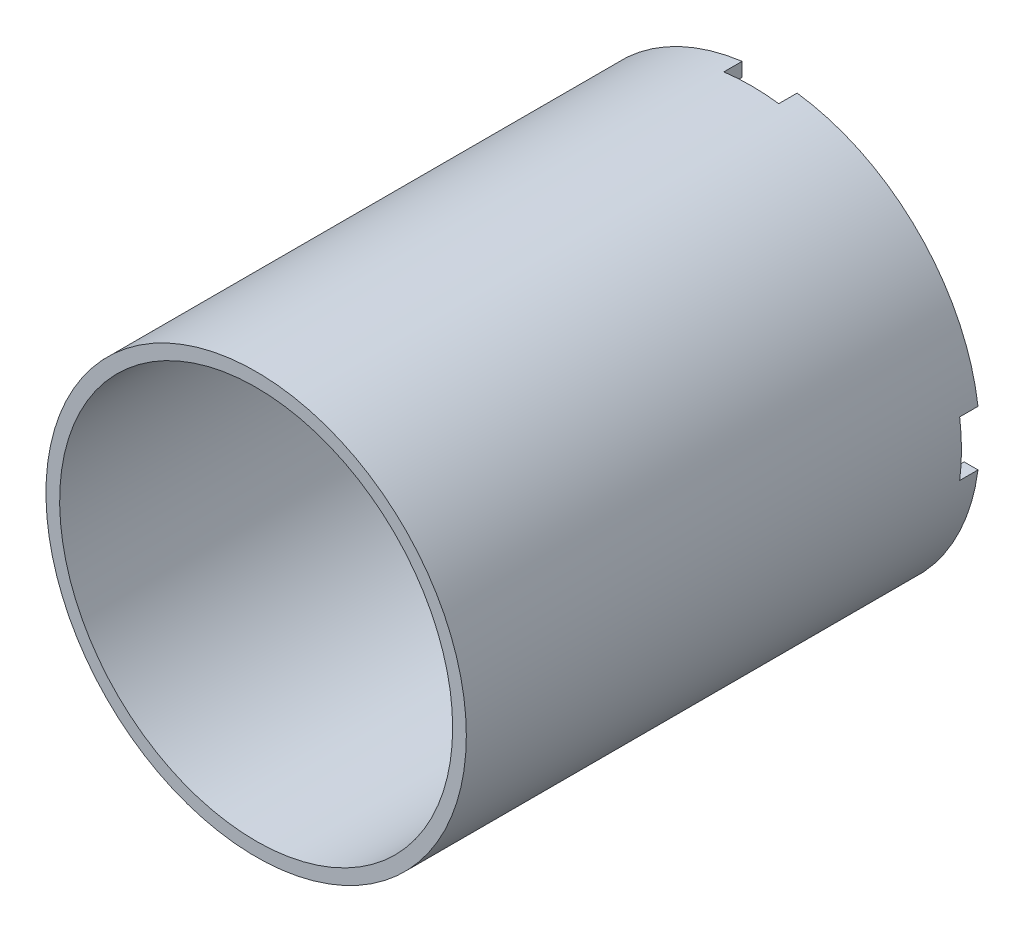
ISO-10303-21;
HEADER;
FILE_DESCRIPTION(('STEP AP214'),'2;1');
FILE_NAME('part.step','',(''),(''),'','','');
FILE_SCHEMA(('AUTOMOTIVE_DESIGN { 1 0 10303 214 1 1 1 1 }'));
ENDSEC;
DATA;
#1=APPLICATION_CONTEXT('core data for automotive mechanical design processes');
#2=APPLICATION_PROTOCOL_DEFINITION('international standard','automotive_design',2000,#1);
#3=PRODUCT_CONTEXT('',#1,'mechanical');
#4=PRODUCT('Part','Part','',(#3));
#5=PRODUCT_RELATED_PRODUCT_CATEGORY('part','',(#4));
#6=PRODUCT_DEFINITION_FORMATION('','',#4);
#7=PRODUCT_DEFINITION_CONTEXT('part definition',#1,'design');
#8=PRODUCT_DEFINITION('design','',#6,#7);
#9=PRODUCT_DEFINITION_SHAPE('','',#8);
#10=(LENGTH_UNIT() NAMED_UNIT(*) SI_UNIT(.MILLI.,.METRE.));
#11=(NAMED_UNIT(*) PLANE_ANGLE_UNIT() SI_UNIT($,.RADIAN.));
#12=(NAMED_UNIT(*) SI_UNIT($,.STERADIAN.) SOLID_ANGLE_UNIT());
#13=UNCERTAINTY_MEASURE_WITH_UNIT(LENGTH_MEASURE(1.E-05),#10,'distance_accuracy_value','');
#14=(GEOMETRIC_REPRESENTATION_CONTEXT(3) GLOBAL_UNCERTAINTY_ASSIGNED_CONTEXT((#13)) GLOBAL_UNIT_ASSIGNED_CONTEXT((#10,
#11,#12)) REPRESENTATION_CONTEXT('',''));
#15=CARTESIAN_POINT('',(0.,0.,0.));
#16=DIRECTION('',(0.,0.,1.));
#17=DIRECTION('',(1.,0.,0.));
#18=AXIS2_PLACEMENT_3D('',#15,#16,#17);
#19=CARTESIAN_POINT('',(0.,0.,0.));
#20=DIRECTION('',(0.,0.,1.));
#21=DIRECTION('',(1.,0.,0.));
#22=AXIS2_PLACEMENT_3D('',#19,#20,#21);
#23=PLANE('',#22);
#24=CARTESIAN_POINT('',(0.,0.,0.));
#25=DIRECTION('',(0.,0.,1.));
#26=DIRECTION('',(1.,0.,0.));
#27=AXIS2_PLACEMENT_3D('',#24,#25,#26);
#28=CIRCLE('',#27,42.8625);
#29=CARTESIAN_POINT('',(-6.,42.4404748589127,0.));
#30=VERTEX_POINT('',#29);
#31=CARTESIAN_POINT('',(-42.4404748589127,5.99999999999999,0.));
#32=VERTEX_POINT('',#31);
#33=EDGE_CURVE('E165',#30,#32,#28,.T.);
#34=ORIENTED_EDGE('',*,*,#33,.T.);
#35=DIRECTION('',(1.,0.,0.));
#36=VECTOR('',#35,1.);
#37=CARTESIAN_POINT('',(-5.99999999999999,6.,0.));
#38=LINE('',#37,#36);
#39=CARTESIAN_POINT('',(-45.4526941885737,5.99999999999999,0.));
#40=VERTEX_POINT('',#39);
#41=EDGE_CURVE('E152',#40,#32,#38,.T.);
#42=ORIENTED_EDGE('',*,*,#41,.F.);
#43=CARTESIAN_POINT('',(0.,0.,0.));
#44=DIRECTION('',(0.,0.,1.));
#45=DIRECTION('',(1.,0.,0.));
#46=AXIS2_PLACEMENT_3D('',#43,#44,#45);
#47=CIRCLE('',#46,45.847);
#48=CARTESIAN_POINT('',(-6.,45.4526941885737,0.));
#49=VERTEX_POINT('',#48);
#50=EDGE_CURVE('E163',#49,#40,#47,.T.);
#51=ORIENTED_EDGE('',*,*,#50,.F.);
#52=DIRECTION('',(0.,1.,0.));
#53=VECTOR('',#52,1.);
#54=CARTESIAN_POINT('',(-6.,45.847,0.));
#55=LINE('',#54,#53);
#56=EDGE_CURVE('E166',#30,#49,#55,.T.);
#57=ORIENTED_EDGE('',*,*,#56,.F.);
#58=EDGE_LOOP('',(#34,#42,#51,#57));
#59=FACE_BOUND('',#58,.T.);
#60=ADVANCED_FACE('F38',(#59),#23,.F.);
#61=CARTESIAN_POINT('',(-45.4526941885737,-5.99999999999999,0.));
#62=VERTEX_POINT('',#61);
#63=CARTESIAN_POINT('',(-6.,-45.4526941885737,0.));
#64=VERTEX_POINT('',#63);
#65=EDGE_CURVE('E174',#62,#64,#47,.T.);
#66=ORIENTED_EDGE('',*,*,#65,.F.);
#67=DIRECTION('',(-1.,0.,0.));
#68=VECTOR('',#67,1.);
#69=CARTESIAN_POINT('',(-5.99999999999999,-6.,0.));
#70=LINE('',#69,#68);
#71=CARTESIAN_POINT('',(-42.4404748589127,-5.99999999999999,0.));
#72=VERTEX_POINT('',#71);
#73=EDGE_CURVE('E271',#72,#62,#70,.T.);
#74=ORIENTED_EDGE('',*,*,#73,.F.);
#75=CARTESIAN_POINT('',(-6.,-42.4404748589127,0.));
#76=VERTEX_POINT('',#75);
#77=EDGE_CURVE('E238',#72,#76,#28,.T.);
#78=ORIENTED_EDGE('',*,*,#77,.T.);
#79=DIRECTION('',(0.,1.,0.));
#80=VECTOR('',#79,1.);
#81=CARTESIAN_POINT('',(-6.,-45.847,0.));
#82=LINE('',#81,#80);
#83=EDGE_CURVE('E273',#64,#76,#82,.T.);
#84=ORIENTED_EDGE('',*,*,#83,.F.);
#85=EDGE_LOOP('',(#66,#74,#78,#84));
#86=FACE_BOUND('',#85,.T.);
#87=ADVANCED_FACE('F303',(#86),#23,.F.);
#88=CARTESIAN_POINT('',(6.,-45.4526941885737,0.));
#89=VERTEX_POINT('',#88);
#90=CARTESIAN_POINT('',(45.4526941885737,-5.99999999999999,0.));
#91=VERTEX_POINT('',#90);
#92=EDGE_CURVE('E177',#89,#91,#47,.T.);
#93=ORIENTED_EDGE('',*,*,#92,.F.);
#94=DIRECTION('',(0.,-1.,0.));
#95=VECTOR('',#94,1.);
#96=CARTESIAN_POINT('',(6.,-45.847,0.));
#97=LINE('',#96,#95);
#98=CARTESIAN_POINT('',(6.,-42.4404748589127,0.));
#99=VERTEX_POINT('',#98);
#100=EDGE_CURVE('E275',#99,#89,#97,.T.);
#101=ORIENTED_EDGE('',*,*,#100,.F.);
#102=CARTESIAN_POINT('',(42.4404748589127,-5.99999999999999,0.));
#103=VERTEX_POINT('',#102);
#104=EDGE_CURVE('E156',#99,#103,#28,.T.);
#105=ORIENTED_EDGE('',*,*,#104,.T.);
#106=DIRECTION('',(-1.,0.,0.));
#107=VECTOR('',#106,1.);
#108=CARTESIAN_POINT('',(5.99999999999999,-6.,0.));
#109=LINE('',#108,#107);
#110=EDGE_CURVE('E277',#91,#103,#109,.T.);
#111=ORIENTED_EDGE('',*,*,#110,.F.);
#112=EDGE_LOOP('',(#93,#101,#105,#111));
#113=FACE_BOUND('',#112,.T.);
#114=ADVANCED_FACE('F324',(#113),#23,.F.);
#115=CARTESIAN_POINT('',(0.,0.,112.));
#116=DIRECTION('',(0.,0.,1.));
#117=DIRECTION('',(1.,0.,0.));
#118=AXIS2_PLACEMENT_3D('',#115,#116,#117);
#119=PLANE('',#118);
#120=CARTESIAN_POINT('',(0.,0.,112.));
#121=DIRECTION('',(0.,0.,1.));
#122=DIRECTION('',(1.,0.,0.));
#123=AXIS2_PLACEMENT_3D('',#120,#121,#122);
#124=CIRCLE('',#123,45.847);
#125=CARTESIAN_POINT('',(45.847,0.,112.));
#126=VERTEX_POINT('',#125);
#127=EDGE_CURVE('E176',#126,#126,#124,.T.);
#128=ORIENTED_EDGE('',*,*,#127,.T.);
#129=EDGE_LOOP('',(#128));
#130=FACE_BOUND('',#129,.T.);
#131=CARTESIAN_POINT('',(0.,0.,112.));
#132=DIRECTION('',(0.,0.,1.));
#133=DIRECTION('',(1.,0.,0.));
#134=AXIS2_PLACEMENT_3D('',#131,#132,#133);
#135=CIRCLE('',#134,42.8625);
#136=CARTESIAN_POINT('',(42.8625,0.,112.));
#137=VERTEX_POINT('',#136);
#138=EDGE_CURVE('E182',#137,#137,#135,.T.);
#139=ORIENTED_EDGE('',*,*,#138,.F.);
#140=EDGE_LOOP('',(#139));
#141=FACE_BOUND('',#140,.T.);
#142=ADVANCED_FACE('F327',(#130,#141),#119,.T.);
#143=CARTESIAN_POINT('',(45.4526941885737,5.99999999999999,0.));
#144=VERTEX_POINT('',#143);
#145=CARTESIAN_POINT('',(6.,45.4526941885737,0.));
#146=VERTEX_POINT('',#145);
#147=EDGE_CURVE('E173',#144,#146,#47,.T.);
#148=ORIENTED_EDGE('',*,*,#147,.F.);
#149=DIRECTION('',(1.,0.,0.));
#150=VECTOR('',#149,1.);
#151=CARTESIAN_POINT('',(5.99999999999999,6.,0.));
#152=LINE('',#151,#150);
#153=CARTESIAN_POINT('',(42.4404748589127,5.99999999999999,0.));
#154=VERTEX_POINT('',#153);
#155=EDGE_CURVE('E279',#154,#144,#152,.T.);
#156=ORIENTED_EDGE('',*,*,#155,.F.);
#157=CARTESIAN_POINT('',(6.,42.4404748589127,0.));
#158=VERTEX_POINT('',#157);
#159=EDGE_CURVE('E239',#154,#158,#28,.T.);
#160=ORIENTED_EDGE('',*,*,#159,.T.);
#161=DIRECTION('',(0.,-1.,0.));
#162=VECTOR('',#161,1.);
#163=CARTESIAN_POINT('',(6.,45.847,0.));
#164=LINE('',#163,#162);
#165=EDGE_CURVE('E281',#146,#158,#164,.T.);
#166=ORIENTED_EDGE('',*,*,#165,.F.);
#167=EDGE_LOOP('',(#148,#156,#160,#166));
#168=FACE_BOUND('',#167,.T.);
#169=ADVANCED_FACE('F320',(#168),#23,.F.);
#170=CARTESIAN_POINT('',(0.,0.,112.));
#171=DIRECTION('',(0.,0.,-1.));
#172=DIRECTION('',(-1.,0.,0.));
#173=AXIS2_PLACEMENT_3D('',#170,#171,#172);
#174=CYLINDRICAL_SURFACE('',#173,45.847);
#175=ORIENTED_EDGE('',*,*,#147,.T.);
#176=DIRECTION('',(0.,0.,-1.));
#177=VECTOR('',#176,1.);
#178=CARTESIAN_POINT('',(6.,45.4526941885737,112.));
#179=LINE('',#178,#177);
#180=CARTESIAN_POINT('',(6.,45.4526941885737,4.));
#181=VERTEX_POINT('',#180);
#182=EDGE_CURVE('E262',#146,#181,#179,.F.);
#183=ORIENTED_EDGE('',*,*,#182,.T.);
#184=CARTESIAN_POINT('',(0.,0.,4.));
#185=DIRECTION('',(0.,0.,1.));
#186=DIRECTION('',(1.,0.,0.));
#187=AXIS2_PLACEMENT_3D('',#184,#185,#186);
#188=CIRCLE('',#187,45.847);
#189=CARTESIAN_POINT('',(-6.,45.4526941885737,4.));
#190=VERTEX_POINT('',#189);
#191=EDGE_CURVE('E266',#181,#190,#188,.T.);
#192=ORIENTED_EDGE('',*,*,#191,.T.);
#193=DIRECTION('',(0.,0.,-1.));
#194=VECTOR('',#193,1.);
#195=CARTESIAN_POINT('',(-6.,45.4526941885737,112.));
#196=LINE('',#195,#194);
#197=EDGE_CURVE('E172',#190,#49,#196,.T.);
#198=ORIENTED_EDGE('',*,*,#197,.T.);
#199=ORIENTED_EDGE('',*,*,#50,.T.);
#200=DIRECTION('',(0.,0.,-1.));
#201=VECTOR('',#200,1.);
#202=CARTESIAN_POINT('',(-45.4526941885737,5.99999999999999,112.));
#203=LINE('',#202,#201);
#204=CARTESIAN_POINT('',(-45.4526941885737,5.99999999999999,4.));
#205=VERTEX_POINT('',#204);
#206=EDGE_CURVE('E149',#40,#205,#203,.F.);
#207=ORIENTED_EDGE('',*,*,#206,.T.);
#208=CARTESIAN_POINT('',(-45.4526941885737,-5.99999999999999,4.));
#209=VERTEX_POINT('',#208);
#210=EDGE_CURVE('E305',#205,#209,#188,.T.);
#211=ORIENTED_EDGE('',*,*,#210,.T.);
#212=DIRECTION('',(0.,0.,-1.));
#213=VECTOR('',#212,1.);
#214=CARTESIAN_POINT('',(-45.4526941885737,-5.99999999999999,112.));
#215=LINE('',#214,#213);
#216=EDGE_CURVE('E157',#209,#62,#215,.T.);
#217=ORIENTED_EDGE('',*,*,#216,.T.);
#218=ORIENTED_EDGE('',*,*,#65,.T.);
#219=DIRECTION('',(0.,0.,-1.));
#220=VECTOR('',#219,1.);
#221=CARTESIAN_POINT('',(-6.,-45.4526941885737,112.));
#222=LINE('',#221,#220);
#223=CARTESIAN_POINT('',(-6.,-45.4526941885737,4.));
#224=VERTEX_POINT('',#223);
#225=EDGE_CURVE('E252',#64,#224,#222,.F.);
#226=ORIENTED_EDGE('',*,*,#225,.T.);
#227=CARTESIAN_POINT('',(6.,-45.4526941885737,4.));
#228=VERTEX_POINT('',#227);
#229=EDGE_CURVE('E269',#224,#228,#188,.T.);
#230=ORIENTED_EDGE('',*,*,#229,.T.);
#231=DIRECTION('',(0.,0.,-1.));
#232=VECTOR('',#231,1.);
#233=CARTESIAN_POINT('',(6.,-45.4526941885737,112.));
#234=LINE('',#233,#232);
#235=EDGE_CURVE('E226',#228,#89,#234,.T.);
#236=ORIENTED_EDGE('',*,*,#235,.T.);
#237=ORIENTED_EDGE('',*,*,#92,.T.);
#238=DIRECTION('',(0.,0.,-1.));
#239=VECTOR('',#238,1.);
#240=CARTESIAN_POINT('',(45.4526941885737,-5.99999999999999,112.));
#241=LINE('',#240,#239);
#242=CARTESIAN_POINT('',(45.4526941885737,-5.99999999999999,4.));
#243=VERTEX_POINT('',#242);
#244=EDGE_CURVE('E256',#91,#243,#241,.F.);
#245=ORIENTED_EDGE('',*,*,#244,.T.);
#246=CARTESIAN_POINT('',(45.4526941885737,5.99999999999999,4.));
#247=VERTEX_POINT('',#246);
#248=EDGE_CURVE('E267',#243,#247,#188,.T.);
#249=ORIENTED_EDGE('',*,*,#248,.T.);
#250=DIRECTION('',(0.,0.,-1.));
#251=VECTOR('',#250,1.);
#252=CARTESIAN_POINT('',(45.4526941885737,5.99999999999999,112.));
#253=LINE('',#252,#251);
#254=EDGE_CURVE('E259',#247,#144,#253,.T.);
#255=ORIENTED_EDGE('',*,*,#254,.T.);
#256=EDGE_LOOP('',(#175,#183,#192,#198,#199,#207,#211,#217,#218,#226,#230,#236,#237,#245,#249,#255));
#257=FACE_BOUND('',#256,.T.);
#258=ORIENTED_EDGE('',*,*,#127,.F.);
#259=EDGE_LOOP('',(#258));
#260=FACE_BOUND('',#259,.T.);
#261=ADVANCED_FACE('F40',(#257,#260),#174,.T.);
#262=CARTESIAN_POINT('',(0.,0.,112.));
#263=DIRECTION('',(0.,0.,-1.));
#264=DIRECTION('',(-1.,0.,0.));
#265=AXIS2_PLACEMENT_3D('',#262,#263,#264);
#266=CYLINDRICAL_SURFACE('',#265,42.8625);
#267=DIRECTION('',(0.,0.,-1.));
#268=VECTOR('',#267,1.);
#269=CARTESIAN_POINT('',(6.,42.4404748589127,112.));
#270=LINE('',#269,#268);
#271=CARTESIAN_POINT('',(6.,42.4404748589127,4.));
#272=VERTEX_POINT('',#271);
#273=EDGE_CURVE('E11',#158,#272,#270,.F.);
#274=ORIENTED_EDGE('',*,*,#273,.F.);
#275=ORIENTED_EDGE('',*,*,#159,.F.);
#276=DIRECTION('',(0.,0.,-1.));
#277=VECTOR('',#276,1.);
#278=CARTESIAN_POINT('',(42.4404748589127,6.,112.));
#279=LINE('',#278,#277);
#280=CARTESIAN_POINT('',(42.4404748589127,5.99999999999999,4.));
#281=VERTEX_POINT('',#280);
#282=EDGE_CURVE('E186',#281,#154,#279,.T.);
#283=ORIENTED_EDGE('',*,*,#282,.F.);
#284=CARTESIAN_POINT('',(0.,0.,4.));
#285=DIRECTION('',(0.,0.,1.));
#286=DIRECTION('',(1.,0.,0.));
#287=AXIS2_PLACEMENT_3D('',#284,#285,#286);
#288=CIRCLE('',#287,42.8625);
#289=CARTESIAN_POINT('',(42.4404748589127,-5.99999999999999,4.));
#290=VERTEX_POINT('',#289);
#291=EDGE_CURVE('E184',#290,#281,#288,.T.);
#292=ORIENTED_EDGE('',*,*,#291,.F.);
#293=DIRECTION('',(0.,0.,-1.));
#294=VECTOR('',#293,1.);
#295=CARTESIAN_POINT('',(42.4404748589127,-6.,112.));
#296=LINE('',#295,#294);
#297=EDGE_CURVE('E190',#103,#290,#296,.F.);
#298=ORIENTED_EDGE('',*,*,#297,.F.);
#299=ORIENTED_EDGE('',*,*,#104,.F.);
#300=DIRECTION('',(0.,0.,-1.));
#301=VECTOR('',#300,1.);
#302=CARTESIAN_POINT('',(6.,-42.4404748589127,112.));
#303=LINE('',#302,#301);
#304=CARTESIAN_POINT('',(6.,-42.4404748589127,4.));
#305=VERTEX_POINT('',#304);
#306=EDGE_CURVE('E193',#305,#99,#303,.T.);
#307=ORIENTED_EDGE('',*,*,#306,.F.);
#308=CARTESIAN_POINT('',(-6.,-42.4404748589127,4.));
#309=VERTEX_POINT('',#308);
#310=EDGE_CURVE('E188',#309,#305,#288,.T.);
#311=ORIENTED_EDGE('',*,*,#310,.F.);
#312=DIRECTION('',(0.,0.,-1.));
#313=VECTOR('',#312,1.);
#314=CARTESIAN_POINT('',(-6.,-42.4404748589127,112.));
#315=LINE('',#314,#313);
#316=EDGE_CURVE('E195',#76,#309,#315,.F.);
#317=ORIENTED_EDGE('',*,*,#316,.F.);
#318=ORIENTED_EDGE('',*,*,#77,.F.);
#319=DIRECTION('',(0.,0.,-1.));
#320=VECTOR('',#319,1.);
#321=CARTESIAN_POINT('',(-42.4404748589127,-6.,112.));
#322=LINE('',#321,#320);
#323=CARTESIAN_POINT('',(-42.4404748589127,-5.99999999999999,4.));
#324=VERTEX_POINT('',#323);
#325=EDGE_CURVE('E199',#324,#72,#322,.T.);
#326=ORIENTED_EDGE('',*,*,#325,.F.);
#327=CARTESIAN_POINT('',(-42.4404748589127,5.99999999999999,4.));
#328=VERTEX_POINT('',#327);
#329=EDGE_CURVE('E198',#328,#324,#288,.T.);
#330=ORIENTED_EDGE('',*,*,#329,.F.);
#331=DIRECTION('',(0.,0.,-1.));
#332=VECTOR('',#331,1.);
#333=CARTESIAN_POINT('',(-42.4404748589127,6.,112.));
#334=LINE('',#333,#332);
#335=EDGE_CURVE('E201',#32,#328,#334,.F.);
#336=ORIENTED_EDGE('',*,*,#335,.F.);
#337=ORIENTED_EDGE('',*,*,#33,.F.);
#338=DIRECTION('',(0.,0.,-1.));
#339=VECTOR('',#338,1.);
#340=CARTESIAN_POINT('',(-6.,42.4404748589127,112.));
#341=LINE('',#340,#339);
#342=CARTESIAN_POINT('',(-6.,42.4404748589127,4.));
#343=VERTEX_POINT('',#342);
#344=EDGE_CURVE('E46',#343,#30,#341,.T.);
#345=ORIENTED_EDGE('',*,*,#344,.F.);
#346=EDGE_CURVE('E187',#272,#343,#288,.T.);
#347=ORIENTED_EDGE('',*,*,#346,.F.);
#348=EDGE_LOOP('',(#274,#275,#283,#292,#298,#299,#307,#311,#317,#318,#326,#330,#336,#337,#345,#347));
#349=FACE_BOUND('',#348,.T.);
#350=ORIENTED_EDGE('',*,*,#138,.T.);
#351=EDGE_LOOP('',(#350));
#352=FACE_BOUND('',#351,.T.);
#353=ADVANCED_FACE('F231',(#349,#352),#266,.F.);
#354=CARTESIAN_POINT('',(0.,0.,4.));
#355=DIRECTION('',(0.,0.,1.));
#356=DIRECTION('',(1.,0.,0.));
#357=AXIS2_PLACEMENT_3D('',#354,#355,#356);
#358=PLANE('',#357);
#359=ORIENTED_EDGE('',*,*,#248,.F.);
#360=DIRECTION('',(-1.,0.,0.));
#361=VECTOR('',#360,1.);
#362=CARTESIAN_POINT('',(5.99999999999999,-6.,4.));
#363=LINE('',#362,#361);
#364=EDGE_CURVE('E227',#243,#290,#363,.T.);
#365=ORIENTED_EDGE('',*,*,#364,.T.);
#366=ORIENTED_EDGE('',*,*,#291,.T.);
#367=DIRECTION('',(1.,0.,0.));
#368=VECTOR('',#367,1.);
#369=CARTESIAN_POINT('',(5.99999999999999,6.,4.));
#370=LINE('',#369,#368);
#371=EDGE_CURVE('E287',#281,#247,#370,.T.);
#372=ORIENTED_EDGE('',*,*,#371,.T.);
#373=EDGE_LOOP('',(#359,#365,#366,#372));
#374=FACE_BOUND('',#373,.T.);
#375=ADVANCED_FACE('F342',(#374),#358,.F.);
#376=CARTESIAN_POINT('',(5.99999999999999,6.,4.));
#377=DIRECTION('',(0.,1.,0.));
#378=DIRECTION('',(-1.,0.,0.));
#379=AXIS2_PLACEMENT_3D('',#376,#377,#378);
#380=PLANE('',#379);
#381=ORIENTED_EDGE('',*,*,#371,.F.);
#382=ORIENTED_EDGE('',*,*,#282,.T.);
#383=ORIENTED_EDGE('',*,*,#155,.T.);
#384=ORIENTED_EDGE('',*,*,#254,.F.);
#385=EDGE_LOOP('',(#381,#382,#383,#384));
#386=FACE_BOUND('',#385,.T.);
#387=ADVANCED_FACE('F346',(#386),#380,.F.);
#388=CARTESIAN_POINT('',(5.99999999999999,-6.,4.));
#389=DIRECTION('',(0.,-1.,0.));
#390=DIRECTION('',(1.,0.,0.));
#391=AXIS2_PLACEMENT_3D('',#388,#389,#390);
#392=PLANE('',#391);
#393=ORIENTED_EDGE('',*,*,#110,.T.);
#394=ORIENTED_EDGE('',*,*,#297,.T.);
#395=ORIENTED_EDGE('',*,*,#364,.F.);
#396=ORIENTED_EDGE('',*,*,#244,.F.);
#397=EDGE_LOOP('',(#393,#394,#395,#396));
#398=FACE_BOUND('',#397,.T.);
#399=ADVANCED_FACE('F340',(#398),#392,.F.);
#400=DIRECTION('',(0.,1.,0.));
#401=VECTOR('',#400,1.);
#402=CARTESIAN_POINT('',(-6.,-45.847,4.));
#403=LINE('',#402,#401);
#404=EDGE_CURVE('E217',#224,#309,#403,.T.);
#405=ORIENTED_EDGE('',*,*,#404,.T.);
#406=ORIENTED_EDGE('',*,*,#310,.T.);
#407=DIRECTION('',(0.,-1.,0.));
#408=VECTOR('',#407,1.);
#409=CARTESIAN_POINT('',(6.,-45.847,4.));
#410=LINE('',#409,#408);
#411=EDGE_CURVE('E215',#305,#228,#410,.T.);
#412=ORIENTED_EDGE('',*,*,#411,.T.);
#413=ORIENTED_EDGE('',*,*,#229,.F.);
#414=EDGE_LOOP('',(#405,#406,#412,#413));
#415=FACE_BOUND('',#414,.T.);
#416=ADVANCED_FACE('F214',(#415),#358,.F.);
#417=CARTESIAN_POINT('',(6.,-45.847,4.));
#418=DIRECTION('',(1.,0.,0.));
#419=DIRECTION('',(0.,1.,0.));
#420=AXIS2_PLACEMENT_3D('',#417,#418,#419);
#421=PLANE('',#420);
#422=ORIENTED_EDGE('',*,*,#411,.F.);
#423=ORIENTED_EDGE('',*,*,#306,.T.);
#424=ORIENTED_EDGE('',*,*,#100,.T.);
#425=ORIENTED_EDGE('',*,*,#235,.F.);
#426=EDGE_LOOP('',(#422,#423,#424,#425));
#427=FACE_BOUND('',#426,.T.);
#428=ADVANCED_FACE('F223',(#427),#421,.F.);
#429=CARTESIAN_POINT('',(-6.,-45.847,4.));
#430=DIRECTION('',(-1.,0.,0.));
#431=DIRECTION('',(0.,-1.,0.));
#432=AXIS2_PLACEMENT_3D('',#429,#430,#431);
#433=PLANE('',#432);
#434=ORIENTED_EDGE('',*,*,#83,.T.);
#435=ORIENTED_EDGE('',*,*,#316,.T.);
#436=ORIENTED_EDGE('',*,*,#404,.F.);
#437=ORIENTED_EDGE('',*,*,#225,.F.);
#438=EDGE_LOOP('',(#434,#435,#436,#437));
#439=FACE_BOUND('',#438,.T.);
#440=ADVANCED_FACE('F309',(#439),#433,.F.);
#441=DIRECTION('',(1.,0.,0.));
#442=VECTOR('',#441,1.);
#443=CARTESIAN_POINT('',(-5.99999999999999,6.,4.));
#444=LINE('',#443,#442);
#445=EDGE_CURVE('E60',#205,#328,#444,.T.);
#446=ORIENTED_EDGE('',*,*,#445,.T.);
#447=ORIENTED_EDGE('',*,*,#329,.T.);
#448=DIRECTION('',(-1.,0.,0.));
#449=VECTOR('',#448,1.);
#450=CARTESIAN_POINT('',(-5.99999999999999,-6.,4.));
#451=LINE('',#450,#449);
#452=EDGE_CURVE('E270',#324,#209,#451,.T.);
#453=ORIENTED_EDGE('',*,*,#452,.T.);
#454=ORIENTED_EDGE('',*,*,#210,.F.);
#455=EDGE_LOOP('',(#446,#447,#453,#454));
#456=FACE_BOUND('',#455,.T.);
#457=ADVANCED_FACE('F306',(#456),#358,.F.);
#458=CARTESIAN_POINT('',(-5.99999999999999,-6.,4.));
#459=DIRECTION('',(0.,-1.,0.));
#460=DIRECTION('',(1.,0.,0.));
#461=AXIS2_PLACEMENT_3D('',#458,#459,#460);
#462=PLANE('',#461);
#463=ORIENTED_EDGE('',*,*,#452,.F.);
#464=ORIENTED_EDGE('',*,*,#325,.T.);
#465=ORIENTED_EDGE('',*,*,#73,.T.);
#466=ORIENTED_EDGE('',*,*,#216,.F.);
#467=EDGE_LOOP('',(#463,#464,#465,#466));
#468=FACE_BOUND('',#467,.T.);
#469=ADVANCED_FACE('F299',(#468),#462,.F.);
#470=CARTESIAN_POINT('',(-5.99999999999999,6.,4.));
#471=DIRECTION('',(0.,1.,0.));
#472=DIRECTION('',(-1.,0.,0.));
#473=AXIS2_PLACEMENT_3D('',#470,#471,#472);
#474=PLANE('',#473);
#475=ORIENTED_EDGE('',*,*,#41,.T.);
#476=ORIENTED_EDGE('',*,*,#335,.T.);
#477=ORIENTED_EDGE('',*,*,#445,.F.);
#478=ORIENTED_EDGE('',*,*,#206,.F.);
#479=EDGE_LOOP('',(#475,#476,#477,#478));
#480=FACE_BOUND('',#479,.T.);
#481=ADVANCED_FACE('F151',(#480),#474,.F.);
#482=CARTESIAN_POINT('',(6.,45.847,4.));
#483=DIRECTION('',(1.,0.,0.));
#484=DIRECTION('',(0.,1.,0.));
#485=AXIS2_PLACEMENT_3D('',#482,#483,#484);
#486=PLANE('',#485);
#487=ORIENTED_EDGE('',*,*,#165,.T.);
#488=ORIENTED_EDGE('',*,*,#273,.T.);
#489=DIRECTION('',(0.,-1.,0.));
#490=VECTOR('',#489,1.);
#491=CARTESIAN_POINT('',(6.,45.847,4.));
#492=LINE('',#491,#490);
#493=EDGE_CURVE('E53',#181,#272,#492,.T.);
#494=ORIENTED_EDGE('',*,*,#493,.F.);
#495=ORIENTED_EDGE('',*,*,#182,.F.);
#496=EDGE_LOOP('',(#487,#488,#494,#495));
#497=FACE_BOUND('',#496,.T.);
#498=ADVANCED_FACE('F348',(#497),#486,.F.);
#499=CARTESIAN_POINT('',(-6.,45.847,4.));
#500=DIRECTION('',(-1.,0.,0.));
#501=DIRECTION('',(0.,-1.,0.));
#502=AXIS2_PLACEMENT_3D('',#499,#500,#501);
#503=PLANE('',#502);
#504=DIRECTION('',(0.,1.,0.));
#505=VECTOR('',#504,1.);
#506=CARTESIAN_POINT('',(-6.,45.847,4.));
#507=LINE('',#506,#505);
#508=EDGE_CURVE('E291',#343,#190,#507,.T.);
#509=ORIENTED_EDGE('',*,*,#508,.F.);
#510=ORIENTED_EDGE('',*,*,#344,.T.);
#511=ORIENTED_EDGE('',*,*,#56,.T.);
#512=ORIENTED_EDGE('',*,*,#197,.F.);
#513=EDGE_LOOP('',(#509,#510,#511,#512));
#514=FACE_BOUND('',#513,.T.);
#515=ADVANCED_FACE('F294',(#514),#503,.F.);
#516=ORIENTED_EDGE('',*,*,#493,.T.);
#517=ORIENTED_EDGE('',*,*,#346,.T.);
#518=ORIENTED_EDGE('',*,*,#508,.T.);
#519=ORIENTED_EDGE('',*,*,#191,.F.);
#520=EDGE_LOOP('',(#516,#517,#518,#519));
#521=FACE_BOUND('',#520,.T.);
#522=ADVANCED_FACE('F293',(#521),#358,.F.);
#523=CLOSED_SHELL('',(#60,#87,#114,#142,#169,#261,#353,#375,#387,#399,#416,#428,#440,#457,#469,
#481,#498,#515,#522));
#524=MANIFOLD_SOLID_BREP('B2',#523);
#525=ADVANCED_BREP_SHAPE_REPRESENTATION('',(#18,#524),#14);
#526=SHAPE_DEFINITION_REPRESENTATION(#9,#525);
ENDSEC;
END-ISO-10303-21;
